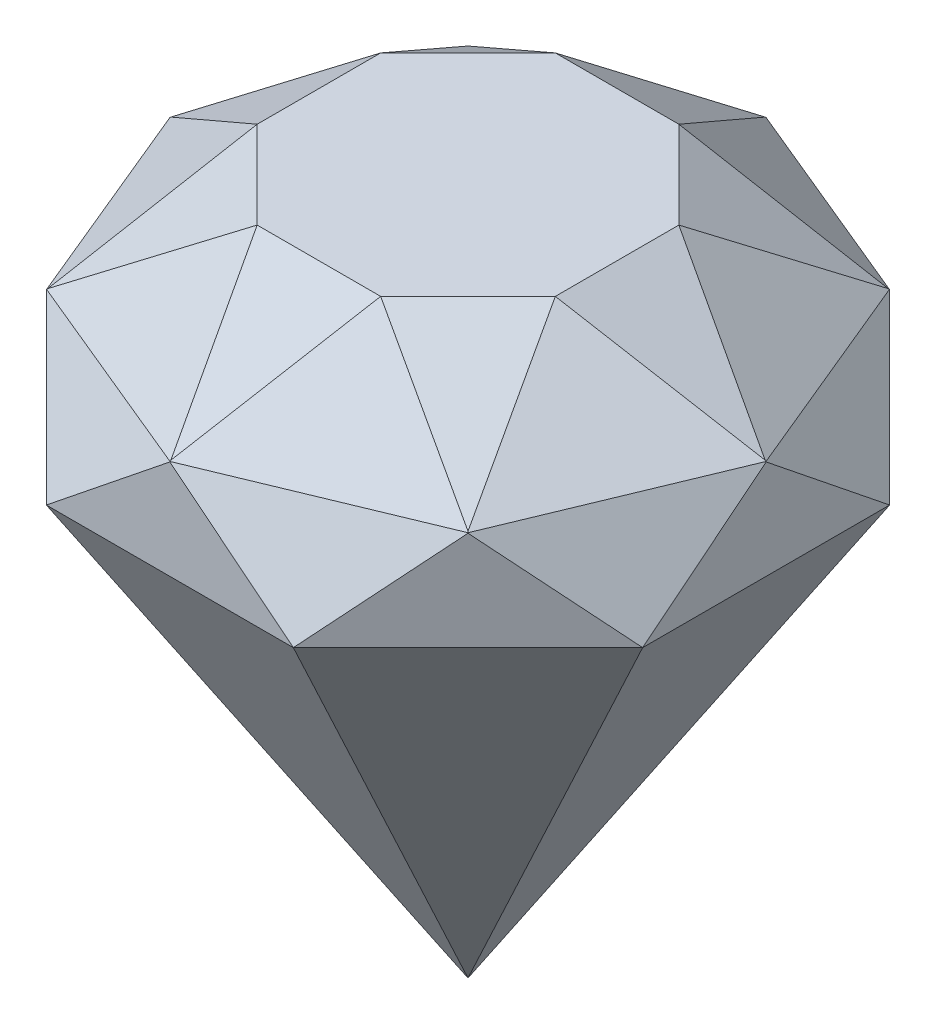
ISO-10303-21;
HEADER;
FILE_DESCRIPTION(('STEP AP214'),'2;1');
FILE_NAME('part.step','',(''),(''),'','','');
FILE_SCHEMA(('AUTOMOTIVE_DESIGN { 1 0 10303 214 1 1 1 1 }'));
ENDSEC;
DATA;
#1=APPLICATION_CONTEXT('core data for automotive mechanical design processes');
#2=APPLICATION_PROTOCOL_DEFINITION('international standard','automotive_design',2000,#1);
#3=PRODUCT_CONTEXT('',#1,'mechanical');
#4=PRODUCT('Part','Part','',(#3));
#5=PRODUCT_RELATED_PRODUCT_CATEGORY('part','',(#4));
#6=PRODUCT_DEFINITION_FORMATION('','',#4);
#7=PRODUCT_DEFINITION_CONTEXT('part definition',#1,'design');
#8=PRODUCT_DEFINITION('design','',#6,#7);
#9=PRODUCT_DEFINITION_SHAPE('','',#8);
#10=(LENGTH_UNIT() NAMED_UNIT(*) SI_UNIT(.MILLI.,.METRE.));
#11=(NAMED_UNIT(*) PLANE_ANGLE_UNIT() SI_UNIT($,.RADIAN.));
#12=(NAMED_UNIT(*) SI_UNIT($,.STERADIAN.) SOLID_ANGLE_UNIT());
#13=UNCERTAINTY_MEASURE_WITH_UNIT(LENGTH_MEASURE(1.E-05),#10,'distance_accuracy_value','');
#14=(GEOMETRIC_REPRESENTATION_CONTEXT(3) GLOBAL_UNCERTAINTY_ASSIGNED_CONTEXT((#13)) GLOBAL_UNIT_ASSIGNED_CONTEXT((#10,
#11,#12)) REPRESENTATION_CONTEXT('',''));
#15=CARTESIAN_POINT('',(0.,0.,0.));
#16=DIRECTION('',(0.,0.,1.));
#17=DIRECTION('',(1.,0.,0.));
#18=AXIS2_PLACEMENT_3D('',#15,#16,#17);
#19=CARTESIAN_POINT('',(-30.,70.,-12.4264068711928));
#20=DIRECTION('',(1.,0.,0.));
#21=DIRECTION('',(0.,0.,-1.));
#22=AXIS2_PLACEMENT_3D('',#19,#20,#21);
#23=PLANE('',#22);
#24=DIRECTION('',(0.,-0.625633794460949,0.780116885619325));
#25=VECTOR('',#24,1.);
#26=CARTESIAN_POINT('',(-30.,69.9582032503442,-12.4599267956623));
#27=LINE('',#26,#25);
#28=CARTESIAN_POINT('',(-30.,59.9656605640165,3.09847456502869E-13));
#29=VERTEX_POINT('',#28);
#30=CARTESIAN_POINT('',(-30.,50.,12.4264068711929));
#31=VERTEX_POINT('',#30);
#32=EDGE_CURVE('E205',#29,#31,#27,.T.);
#33=ORIENTED_EDGE('',*,*,#32,.F.);
#34=DIRECTION('',(0.,0.625633794460936,0.780116885619335));
#35=VECTOR('',#34,1.);
#36=CARTESIAN_POINT('',(-30.,57.8283528954318,-2.66505712573136));
#37=LINE('',#36,#35);
#38=CARTESIAN_POINT('',(-30.,50.,-12.4264068711929));
#39=VERTEX_POINT('',#38);
#40=EDGE_CURVE('E378',#39,#29,#37,.T.);
#41=ORIENTED_EDGE('',*,*,#40,.F.);
#42=DIRECTION('',(0.,0.,-1.));
#43=VECTOR('',#42,1.);
#44=CARTESIAN_POINT('',(-29.9999999999999,50.,30.0000000000003));
#45=LINE('',#44,#43);
#46=EDGE_CURVE('E329',#31,#39,#45,.T.);
#47=ORIENTED_EDGE('',*,*,#46,.F.);
#48=EDGE_LOOP('',(#33,#41,#47));
#49=FACE_BOUND('',#48,.T.);
#50=ADVANCED_FACE('F32',(#49),#23,.F.);
#51=CARTESIAN_POINT('',(-14.9999999999999,70.,30.0000000000002));
#52=DIRECTION('',(0.554700196225229,-0.832050294337844,0.));
#53=DIRECTION('',(0.832050294337844,0.554700196225229,0.));
#54=AXIS2_PLACEMENT_3D('',#51,#52,#53);
#55=PLANE('',#54);
#56=DIRECTION('',(-0.786064837904814,-0.524043225269876,-0.327842597382378));
#57=VECTOR('',#56,1.);
#58=CARTESIAN_POINT('',(-8.87001079003774,74.0866594733082,8.76982661426019));
#59=LINE('',#58,#57);
#60=CARTESIAN_POINT('',(-15.,70.,6.21320343559645));
#61=VERTEX_POINT('',#60);
#62=CARTESIAN_POINT('',(-29.8973342404774,60.0684438396818,3.01080993055436E-13));
#63=VERTEX_POINT('',#62);
#64=EDGE_CURVE('E47',#61,#63,#59,.T.);
#65=ORIENTED_EDGE('',*,*,#64,.F.);
#66=DIRECTION('',(0.,0.,-1.));
#67=VECTOR('',#66,1.);
#68=CARTESIAN_POINT('',(-14.9999999999999,70.,30.0000000000002));
#69=LINE('',#68,#67);
#70=CARTESIAN_POINT('',(-15.,70.,-6.2132034355964));
#71=VERTEX_POINT('',#70);
#72=EDGE_CURVE('E332',#61,#71,#69,.T.);
#73=ORIENTED_EDGE('',*,*,#72,.T.);
#74=DIRECTION('',(0.786064837904806,0.524043225269872,-0.327842597382404));
#75=VECTOR('',#74,1.);
#76=CARTESIAN_POINT('',(-24.3323430802188,63.7784379465208,-2.32098049475403));
#77=LINE('',#76,#75);
#78=EDGE_CURVE('E376',#63,#71,#77,.T.);
#79=ORIENTED_EDGE('',*,*,#78,.F.);
#80=EDGE_LOOP('',(#65,#73,#79));
#81=FACE_BOUND('',#80,.T.);
#82=ADVANCED_FACE('F504',(#81),#55,.F.);
#83=CARTESIAN_POINT('',(-18.6544923551672,21.8943527744636,57.3904784281631));
#84=DIRECTION('',(0.345377445761166,0.430658924974649,0.833814913694384));
#85=DIRECTION('',(0.,-0.888489101827644,0.458897718379059));
#86=AXIS2_PLACEMENT_3D('',#83,#84,#85);
#87=PLANE('',#86);
#88=DIRECTION('',(0.923879532511286,0.,-0.382683432365091));
#89=VECTOR('',#88,1.);
#90=CARTESIAN_POINT('',(-25.6128723590835,60.,40.5914630505627));
#91=LINE('',#90,#89);
#92=CARTESIAN_POINT('',(1.97722553665306E-13,60.,29.9822639480992));
#93=VERTEX_POINT('',#92);
#94=CARTESIAN_POINT('',(21.200662153026,60.,21.2006621530259));
#95=VERTEX_POINT('',#94);
#96=EDGE_CURVE('E279',#93,#95,#91,.T.);
#97=ORIENTED_EDGE('',*,*,#96,.F.);
#98=DIRECTION('',(0.,-0.888489101827645,0.458897718379058));
#99=VECTOR('',#98,1.);
#100=CARTESIAN_POINT('',(3.67761376907083E-13,18.7438798377243,51.2907294911163));
#101=LINE('',#100,#99);
#102=CARTESIAN_POINT('',(2.2139408362154E-13,59.9656605640164,30.));
#103=VERTEX_POINT('',#102);
#104=EDGE_CURVE('E199',#93,#103,#101,.T.);
#105=ORIENTED_EDGE('',*,*,#104,.T.);
#106=DIRECTION('',(0.78011688561933,-0.625633794460942,0.));
#107=VECTOR('',#106,1.);
#108=CARTESIAN_POINT('',(-12.4599267956625,69.958203250344,30.));
#109=LINE('',#108,#107);
#110=CARTESIAN_POINT('',(12.426406871193,50.,30.));
#111=VERTEX_POINT('',#110);
#112=EDGE_CURVE('E284',#103,#111,#109,.T.);
#113=ORIENTED_EDGE('',*,*,#112,.T.);
#114=DIRECTION('',(0.55162593993955,0.625633794460949,-0.55162593993956));
#115=VECTOR('',#114,1.);
#116=CARTESIAN_POINT('',(19.3287234697424,57.8283528954322,23.0976834014505));
#117=LINE('',#116,#115);
#118=CARTESIAN_POINT('',(21.2132034355965,59.9656605640166,21.2132034355964));
#119=VERTEX_POINT('',#118);
#120=EDGE_CURVE('E360',#111,#119,#117,.T.);
#121=ORIENTED_EDGE('',*,*,#120,.T.);
#122=DIRECTION('',(-0.324489688536868,0.888489101827644,-0.324489688536867));
#123=VECTOR('',#122,1.);
#124=CARTESIAN_POINT('',(31.8007953039603,30.9756484867253,31.8007953039602));
#125=LINE('',#124,#123);
#126=EDGE_CURVE('E365',#119,#95,#125,.T.);
#127=ORIENTED_EDGE('',*,*,#126,.T.);
#128=EDGE_LOOP('',(#97,#105,#113,#121,#127));
#129=FACE_BOUND('',#128,.T.);
#130=ADVANCED_FACE('F506',(#129),#87,.T.);
#131=CARTESIAN_POINT('',(-20.2586000833427,47.795494651662,53.5178197952943));
#132=DIRECTION('',(0.251555377840445,0.753589008182481,0.607308404870289));
#133=DIRECTION('',(0.,-0.627486548407002,0.77862740227163));
#134=AXIS2_PLACEMENT_3D('',#131,#132,#133);
#135=PLANE('',#134);
#136=DIRECTION('',(-0.327842597382391,-0.524043225269874,0.786064837904811));
#137=VECTOR('',#136,1.);
#138=CARTESIAN_POINT('',(8.7698266142603,74.0866594733083,8.87001079003763));
#139=LINE('',#138,#137);
#140=CARTESIAN_POINT('',(6.21320343559661,70.,14.9999999999999));
#141=VERTEX_POINT('',#140);
#142=CARTESIAN_POINT('',(1.98842678433842E-13,60.0684438396821,29.8973342404769));
#143=VERTEX_POINT('',#142);
#144=EDGE_CURVE('E281',#141,#143,#139,.T.);
#145=ORIENTED_EDGE('',*,*,#144,.T.);
#146=DIRECTION('',(0.,-0.627486548407003,0.77862740227163));
#147=VECTOR('',#146,1.);
#148=CARTESIAN_POINT('',(3.46944695195361E-13,43.6956457626062,50.2138004133942));
#149=LINE('',#148,#147);
#150=EDGE_CURVE('E210',#143,#93,#149,.T.);
#151=ORIENTED_EDGE('',*,*,#150,.T.);
#152=ORIENTED_EDGE('',*,*,#96,.T.);
#153=DIRECTION('',(-0.550572716163937,0.627486548407002,-0.550572716163935));
#154=VECTOR('',#153,1.);
#155=CARTESIAN_POINT('',(22.6457886690081,58.3529923970024,22.645788669008));
#156=LINE('',#155,#154);
#157=CARTESIAN_POINT('',(21.1406077808423,60.0684438396818,21.1406077808422));
#158=VERTEX_POINT('',#157);
#159=EDGE_CURVE('E363',#95,#158,#156,.T.);
#160=ORIENTED_EDGE('',*,*,#159,.T.);
#161=DIRECTION('',(-0.787651501105693,0.524043225269875,-0.324012053563898));
#162=VECTOR('',#161,1.);
#163=CARTESIAN_POINT('',(18.7732015335419,61.6435353663504,20.1667403296522));
#164=LINE('',#163,#162);
#165=EDGE_CURVE('E358',#158,#141,#164,.T.);
#166=ORIENTED_EDGE('',*,*,#165,.T.);
#167=EDGE_LOOP('',(#145,#151,#152,#160,#166));
#168=FACE_BOUND('',#167,.T.);
#169=ADVANCED_FACE('F497',(#168),#135,.T.);
#170=CARTESIAN_POINT('',(-12.4264068711929,70.,30.));
#171=DIRECTION('',(0.,0.,-1.));
#172=DIRECTION('',(-1.,0.,0.));
#173=AXIS2_PLACEMENT_3D('',#170,#171,#172);
#174=PLANE('',#173);
#175=DIRECTION('',(0.78011688561934,0.62563379446093,0.));
#176=VECTOR('',#175,1.);
#177=CARTESIAN_POINT('',(-2.6650571257315,57.8283528954317,30.));
#178=LINE('',#177,#176);
#179=CARTESIAN_POINT('',(-12.4264068711926,50.,30.0000000000002));
#180=VERTEX_POINT('',#179);
#181=EDGE_CURVE('E212',#180,#103,#178,.T.);
#182=ORIENTED_EDGE('',*,*,#181,.F.);
#183=DIRECTION('',(-1.,0.,0.));
#184=VECTOR('',#183,1.);
#185=CARTESIAN_POINT('',(30.0000000000001,50.,30.));
#186=LINE('',#185,#184);
#187=EDGE_CURVE('E311',#111,#180,#186,.T.);
#188=ORIENTED_EDGE('',*,*,#187,.F.);
#189=ORIENTED_EDGE('',*,*,#112,.F.);
#190=EDGE_LOOP('',(#182,#188,#189));
#191=FACE_BOUND('',#190,.T.);
#192=ADVANCED_FACE('F453',(#191),#174,.F.);
#193=CARTESIAN_POINT('',(30.0000000000001,70.,15.));
#194=DIRECTION('',(0.,-0.832050294337844,-0.554700196225229));
#195=DIRECTION('',(0.,0.554700196225229,-0.832050294337844));
#196=AXIS2_PLACEMENT_3D('',#193,#194,#195);
#197=PLANE('',#196);
#198=DIRECTION('',(-0.32784259738241,0.52404322526987,-0.786064837904805));
#199=VECTOR('',#198,1.);
#200=CARTESIAN_POINT('',(-2.32098049475389,63.7784379465206,24.332343080219));
#201=LINE('',#200,#199);
#202=CARTESIAN_POINT('',(-6.21320343559615,70.,15.0000000000002));
#203=VERTEX_POINT('',#202);
#204=EDGE_CURVE('E208',#143,#203,#201,.T.);
#205=ORIENTED_EDGE('',*,*,#204,.F.);
#206=ORIENTED_EDGE('',*,*,#144,.F.);
#207=DIRECTION('',(-1.,0.,0.));
#208=VECTOR('',#207,1.);
#209=CARTESIAN_POINT('',(30.0000000000001,70.,15.));
#210=LINE('',#209,#208);
#211=EDGE_CURVE('E314',#141,#203,#210,.T.);
#212=ORIENTED_EDGE('',*,*,#211,.T.);
#213=EDGE_LOOP('',(#205,#206,#212));
#214=FACE_BOUND('',#213,.T.);
#215=ADVANCED_FACE('F500',(#214),#197,.F.);
#216=CARTESIAN_POINT('',(-30.,70.,12.426406871193));
#217=DIRECTION('',(0.707106781186544,0.,-0.707106781186551));
#218=DIRECTION('',(-0.707106781186551,0.,-0.707106781186544));
#219=AXIS2_PLACEMENT_3D('',#216,#217,#218);
#220=PLANE('',#219);
#221=DIRECTION('',(0.551625939939558,-0.625633794460949,0.551625939939552));
#222=VECTOR('',#221,1.);
#223=CARTESIAN_POINT('',(-30.0237021658972,69.9582032503442,12.4027047052958));
#224=LINE('',#223,#222);
#225=CARTESIAN_POINT('',(-21.2132034355962,59.9656605640166,21.2132034355967));
#226=VERTEX_POINT('',#225);
#227=EDGE_CURVE('E11',#226,#180,#224,.T.);
#228=ORIENTED_EDGE('',*,*,#227,.F.);
#229=DIRECTION('',(0.551625939939565,0.625633794460936,0.551625939939559));
#230=VECTOR('',#229,1.);
#231=CARTESIAN_POINT('',(-23.0976834014506,57.8283528954318,19.3287234697423));
#232=LINE('',#231,#230);
#233=EDGE_CURVE('E178',#31,#226,#232,.T.);
#234=ORIENTED_EDGE('',*,*,#233,.F.);
#235=DIRECTION('',(-0.707106781186551,0.,-0.707106781186544));
#236=VECTOR('',#235,1.);
#237=CARTESIAN_POINT('',(8.78679656440395,50.,51.2132034355965));
#238=LINE('',#237,#236);
#239=EDGE_CURVE('E317',#180,#31,#238,.T.);
#240=ORIENTED_EDGE('',*,*,#239,.F.);
#241=EDGE_LOOP('',(#228,#234,#240));
#242=FACE_BOUND('',#241,.T.);
#243=ADVANCED_FACE('F448',(#242),#220,.F.);
#244=CARTESIAN_POINT('',(19.3933982822021,70.,40.6066017177982));
#245=DIRECTION('',(0.392232270276366,-0.832050294337844,-0.39223227027637));
#246=DIRECTION('',(0.,0.426401432711223,-0.90453403373329));
#247=AXIS2_PLACEMENT_3D('',#244,#245,#246);
#248=PLANE('',#247);
#249=DIRECTION('',(-0.787651501105689,-0.524043225269876,0.324012053563909));
#250=VECTOR('',#249,1.);
#251=CARTESIAN_POINT('',(3.1379768761445,76.2215620534789,11.1532541589774));
#252=LINE('',#251,#250);
#253=CARTESIAN_POINT('',(-21.1406077808421,60.0684438396817,21.1406077808426));
#254=VERTEX_POINT('',#253);
#255=EDGE_CURVE('E40',#203,#254,#252,.T.);
#256=ORIENTED_EDGE('',*,*,#255,.F.);
#257=DIRECTION('',(-0.707106781186551,0.,-0.707106781186544));
#258=VECTOR('',#257,1.);
#259=CARTESIAN_POINT('',(19.3933982822021,70.,40.6066017177982));
#260=LINE('',#259,#258);
#261=EDGE_CURVE('E328',#203,#61,#260,.T.);
#262=ORIENTED_EDGE('',*,*,#261,.T.);
#263=DIRECTION('',(0.324012053563883,0.524043225269872,-0.787651501105702));
#264=VECTOR('',#263,1.);
#265=CARTESIAN_POINT('',(-20.1667403296523,61.64353536635,18.7732015335426));
#266=LINE('',#265,#264);
#267=EDGE_CURVE('E203',#254,#61,#266,.T.);
#268=ORIENTED_EDGE('',*,*,#267,.F.);
#269=EDGE_LOOP('',(#256,#262,#268));
#270=FACE_BOUND('',#269,.T.);
#271=ADVANCED_FACE('F502',(#270),#248,.F.);
#272=CARTESIAN_POINT('',(-27.3904784281636,21.8943527744636,-53.7719145160255));
#273=DIRECTION('',(-0.833814913694387,0.430658924974649,-0.345377445761158));
#274=DIRECTION('',(-0.458897718379058,-0.888489101827645,0.));
#275=AXIS2_PLACEMENT_3D('',#272,#273,#274);
#276=PLANE('',#275);
#277=ORIENTED_EDGE('',*,*,#40,.T.);
#278=DIRECTION('',(0.458897718379059,0.888489101827644,0.));
#279=VECTOR('',#278,1.);
#280=CARTESIAN_POINT('',(-44.9731160131113,30.9756484867253,4.71844785465692E-13));
#281=LINE('',#280,#279);
#282=CARTESIAN_POINT('',(-29.9822639480993,60.,3.03053162670925E-13));
#283=VERTEX_POINT('',#282);
#284=EDGE_CURVE('E382',#29,#283,#281,.T.);
#285=ORIENTED_EDGE('',*,*,#284,.T.);
#286=DIRECTION('',(-0.382683432365081,0.,0.923879532511291));
#287=VECTOR('',#286,1.);
#288=CARTESIAN_POINT('',(-10.5914630505631,60.,-46.8135345121093));
#289=LINE('',#288,#287);
#290=CARTESIAN_POINT('',(-21.2006621530261,60.,-21.2006621530259));
#291=VERTEX_POINT('',#290);
#292=EDGE_CURVE('E215',#291,#283,#289,.T.);
#293=ORIENTED_EDGE('',*,*,#292,.F.);
#294=DIRECTION('',(0.324489688536869,0.888489101827644,0.324489688536866));
#295=VECTOR('',#294,1.);
#296=CARTESIAN_POINT('',(-31.8007953039604,30.9756484867255,-31.8007953039601));
#297=LINE('',#296,#295);
#298=CARTESIAN_POINT('',(-21.2132034355965,59.9656605640167,-21.2132034355963));
#299=VERTEX_POINT('',#298);
#300=EDGE_CURVE('E221',#299,#291,#297,.T.);
#301=ORIENTED_EDGE('',*,*,#300,.F.);
#302=DIRECTION('',(-0.551625939939554,-0.625633794460949,0.551625939939556));
#303=VECTOR('',#302,1.);
#304=CARTESIAN_POINT('',(-12.4027047052957,69.9582032503442,-30.0237021658972));
#305=LINE('',#304,#303);
#306=EDGE_CURVE('E236',#299,#39,#305,.T.);
#307=ORIENTED_EDGE('',*,*,#306,.T.);
#308=EDGE_LOOP('',(#277,#285,#293,#301,#307));
#309=FACE_BOUND('',#308,.T.);
#310=ADVANCED_FACE('F385',(#309),#276,.T.);
#311=CARTESIAN_POINT('',(-23.5178197952947,47.795494651662,-52.16780678785));
#312=DIRECTION('',(-0.607308404870292,0.753589008182481,-0.251555377840439));
#313=DIRECTION('',(-0.778627402271629,-0.627486548407003,0.));
#314=AXIS2_PLACEMENT_3D('',#311,#312,#313);
#315=PLANE('',#314);
#316=ORIENTED_EDGE('',*,*,#292,.T.);
#317=DIRECTION('',(0.77862740227163,0.627486548407002,0.));
#318=VECTOR('',#317,1.);
#319=CARTESIAN_POINT('',(-32.0259814663462,58.3529923970024,3.2612801348364E-13));
#320=LINE('',#319,#318);
#321=EDGE_CURVE('E188',#283,#63,#320,.T.);
#322=ORIENTED_EDGE('',*,*,#321,.T.);
#323=ORIENTED_EDGE('',*,*,#78,.T.);
#324=DIRECTION('',(-0.324012053563906,-0.524043225269875,-0.78765150110569));
#325=VECTOR('',#324,1.);
#326=CARTESIAN_POINT('',(-11.1532541589774,76.2215620534789,3.13797687614447));
#327=LINE('',#326,#325);
#328=CARTESIAN_POINT('',(-21.1406077808426,60.0684438396816,-21.1406077808423));
#329=VERTEX_POINT('',#328);
#330=EDGE_CURVE('E234',#71,#329,#327,.T.);
#331=ORIENTED_EDGE('',*,*,#330,.T.);
#332=DIRECTION('',(0.550572716163939,0.627486548407001,0.550572716163933));
#333=VECTOR('',#332,1.);
#334=CARTESIAN_POINT('',(-22.6457886690081,58.3529923970025,-22.6457886690079));
#335=LINE('',#334,#333);
#336=EDGE_CURVE('E223',#291,#329,#335,.T.);
#337=ORIENTED_EDGE('',*,*,#336,.F.);
#338=EDGE_LOOP('',(#316,#322,#323,#331,#337));
#339=FACE_BOUND('',#338,.T.);
#340=ADVANCED_FACE('F391',(#339),#315,.T.);
#341=CARTESIAN_POINT('',(12.4264068711929,70.,-30.));
#342=DIRECTION('',(0.,0.,1.));
#343=DIRECTION('',(1.,0.,0.));
#344=AXIS2_PLACEMENT_3D('',#341,#342,#343);
#345=PLANE('',#344);
#346=DIRECTION('',(-0.78011688561933,-0.625633794460942,0.));
#347=VECTOR('',#346,1.);
#348=CARTESIAN_POINT('',(12.4599267956625,69.958203250344,-30.));
#349=LINE('',#348,#347);
#350=CARTESIAN_POINT('',(-1.04678456804118E-13,59.965660564016,-30.0000000000003));
#351=VERTEX_POINT('',#350);
#352=CARTESIAN_POINT('',(-12.4264068711928,50.,-30.0000000000001));
#353=VERTEX_POINT('',#352);
#354=EDGE_CURVE('E232',#351,#353,#349,.T.);
#355=ORIENTED_EDGE('',*,*,#354,.F.);
#356=DIRECTION('',(-0.780116885619335,0.625633794460936,0.));
#357=VECTOR('',#356,1.);
#358=CARTESIAN_POINT('',(2.66505712573147,57.8283528954318,-30.));
#359=LINE('',#358,#357);
#360=CARTESIAN_POINT('',(12.4264068711924,50.,-30.0000000000003));
#361=VERTEX_POINT('',#360);
#362=EDGE_CURVE('E276',#361,#351,#359,.T.);
#363=ORIENTED_EDGE('',*,*,#362,.F.);
#364=DIRECTION('',(1.,0.,0.));
#365=VECTOR('',#364,1.);
#366=CARTESIAN_POINT('',(-12.4264068711929,50.,-30.));
#367=LINE('',#366,#365);
#368=EDGE_CURVE('E346',#353,#361,#367,.T.);
#369=ORIENTED_EDGE('',*,*,#368,.F.);
#370=EDGE_LOOP('',(#355,#363,#369));
#371=FACE_BOUND('',#370,.T.);
#372=ADVANCED_FACE('F34',(#371),#345,.F.);
#373=CARTESIAN_POINT('',(-12.4264068711929,70.,-15.));
#374=DIRECTION('',(0.,-0.832050294337843,0.554700196225229));
#375=DIRECTION('',(0.,-0.554700196225229,-0.832050294337844));
#376=AXIS2_PLACEMENT_3D('',#373,#374,#375);
#377=PLANE('',#376);
#378=DIRECTION('',(0.327842597382391,-0.524043225269874,-0.78606483790481));
#379=VECTOR('',#378,1.);
#380=CARTESIAN_POINT('',(-6.88100331668556,71.0674512900854,-13.3988230648719));
#381=LINE('',#380,#379);
#382=CARTESIAN_POINT('',(-6.21320343559658,70.,-14.9999999999999));
#383=VERTEX_POINT('',#382);
#384=CARTESIAN_POINT('',(-1.02253603365216E-13,60.0684438396819,-29.8973342404772));
#385=VERTEX_POINT('',#384);
#386=EDGE_CURVE('E228',#383,#385,#381,.T.);
#387=ORIENTED_EDGE('',*,*,#386,.F.);
#388=DIRECTION('',(1.,0.,0.));
#389=VECTOR('',#388,1.);
#390=CARTESIAN_POINT('',(0.,70.,-15.));
#391=LINE('',#390,#389);
#392=CARTESIAN_POINT('',(6.21320343559625,70.,-15.0000000000001));
#393=VERTEX_POINT('',#392);
#394=EDGE_CURVE('E355',#383,#393,#391,.T.);
#395=ORIENTED_EDGE('',*,*,#394,.T.);
#396=DIRECTION('',(0.327842597382401,0.524043225269872,0.786064837904808));
#397=VECTOR('',#396,1.);
#398=CARTESIAN_POINT('',(4.20980379232898,66.7976461297437,-19.8035308053844));
#399=LINE('',#398,#397);
#400=EDGE_CURVE('E272',#385,#393,#399,.T.);
#401=ORIENTED_EDGE('',*,*,#400,.F.);
#402=EDGE_LOOP('',(#387,#395,#401));
#403=FACE_BOUND('',#402,.T.);
#404=ADVANCED_FACE('F410',(#403),#377,.F.);
#405=CARTESIAN_POINT('',(-12.4264068711929,70.,-30.));
#406=DIRECTION('',(0.707106781186549,0.,0.707106781186546));
#407=DIRECTION('',(0.707106781186546,0.,-0.707106781186549));
#408=AXIS2_PLACEMENT_3D('',#405,#406,#407);
#409=PLANE('',#408);
#410=DIRECTION('',(-0.551625939939558,0.625633794460943,0.55162593993956));
#411=VECTOR('',#410,1.);
#412=CARTESIAN_POINT('',(-19.3287234697423,57.828352895432,-23.0976834014506));
#413=LINE('',#412,#411);
#414=EDGE_CURVE('E230',#353,#299,#413,.T.);
#415=ORIENTED_EDGE('',*,*,#414,.F.);
#416=DIRECTION('',(0.707106781186546,0.,-0.707106781186549));
#417=VECTOR('',#416,1.);
#418=CARTESIAN_POINT('',(-51.2132034355965,50.,8.78679656440373));
#419=LINE('',#418,#417);
#420=EDGE_CURVE('E335',#39,#353,#419,.T.);
#421=ORIENTED_EDGE('',*,*,#420,.F.);
#422=ORIENTED_EDGE('',*,*,#306,.F.);
#423=EDGE_LOOP('',(#415,#421,#422));
#424=FACE_BOUND('',#423,.T.);
#425=ADVANCED_FACE('F437',(#424),#409,.F.);
#426=CARTESIAN_POINT('',(-40.6066017177982,70.,19.3933982822019));
#427=DIRECTION('',(0.392232270276369,-0.832050294337844,0.392232270276367));
#428=DIRECTION('',(0.904534033733291,0.426401432711221,0.));
#429=AXIS2_PLACEMENT_3D('',#426,#427,#428);
#430=PLANE('',#429);
#431=DIRECTION('',(0.787651501105696,0.524043225269874,0.324012053563894));
#432=VECTOR('',#431,1.);
#433=CARTESIAN_POINT('',(-18.7732015335421,61.6435353663502,-20.1667403296523));
#434=LINE('',#433,#432);
#435=EDGE_CURVE('E226',#329,#383,#434,.T.);
#436=ORIENTED_EDGE('',*,*,#435,.F.);
#437=ORIENTED_EDGE('',*,*,#330,.F.);
#438=DIRECTION('',(0.707106781186546,0.,-0.707106781186549));
#439=VECTOR('',#438,1.);
#440=CARTESIAN_POINT('',(-40.6066017177982,70.,19.3933982822019));
#441=LINE('',#440,#439);
#442=EDGE_CURVE('E343',#71,#383,#441,.T.);
#443=ORIENTED_EDGE('',*,*,#442,.T.);
#444=EDGE_LOOP('',(#436,#437,#443));
#445=FACE_BOUND('',#444,.T.);
#446=ADVANCED_FACE('F400',(#445),#430,.F.);
#447=CARTESIAN_POINT('',(12.4264068711931,70.,29.9999999999999));
#448=DIRECTION('',(-0.707106781186554,0.,-0.707106781186541));
#449=DIRECTION('',(-0.707106781186541,0.,0.707106781186554));
#450=AXIS2_PLACEMENT_3D('',#447,#448,#449);
#451=PLANE('',#450);
#452=DIRECTION('',(0.551625939939557,-0.625633794460936,-0.551625939939567));
#453=VECTOR('',#452,1.);
#454=CARTESIAN_POINT('',(12.4027047052956,69.9582032503437,30.0237021658974));
#455=LINE('',#454,#453);
#456=CARTESIAN_POINT('',(30.0000000000001,50.,12.4264068711927));
#457=VERTEX_POINT('',#456);
#458=EDGE_CURVE('E266',#119,#457,#455,.T.);
#459=ORIENTED_EDGE('',*,*,#458,.F.);
#460=ORIENTED_EDGE('',*,*,#120,.F.);
#461=DIRECTION('',(-0.707106781186541,0.,0.707106781186554));
#462=VECTOR('',#461,1.);
#463=CARTESIAN_POINT('',(51.2132034355965,50.,-8.78679656440417));
#464=LINE('',#463,#462);
#465=EDGE_CURVE('E299',#457,#111,#464,.T.);
#466=ORIENTED_EDGE('',*,*,#465,.F.);
#467=EDGE_LOOP('',(#459,#460,#466));
#468=FACE_BOUND('',#467,.T.);
#469=ADVANCED_FACE('F520',(#468),#451,.F.);
#470=CARTESIAN_POINT('',(40.6066017177982,70.,-19.3933982822023));
#471=DIRECTION('',(-0.392232270276372,-0.832050294337844,-0.392232270276365));
#472=DIRECTION('',(0.904534033733289,-0.426401432711224,0.));
#473=AXIS2_PLACEMENT_3D('',#470,#471,#472);
#474=PLANE('',#473);
#475=DIRECTION('',(0.324012053563894,-0.524043225269872,0.787651501105697));
#476=VECTOR('',#475,1.);
#477=CARTESIAN_POINT('',(11.1532541589773,76.2215620534792,-3.13797687614521));
#478=LINE('',#477,#476);
#479=CARTESIAN_POINT('',(15.0000000000001,70.,6.21320343559631));
#480=VERTEX_POINT('',#479);
#481=EDGE_CURVE('E55',#480,#158,#478,.T.);
#482=ORIENTED_EDGE('',*,*,#481,.F.);
#483=DIRECTION('',(-0.707106781186541,0.,0.707106781186554));
#484=VECTOR('',#483,1.);
#485=CARTESIAN_POINT('',(40.6066017177982,70.,-19.3933982822023));
#486=LINE('',#485,#484);
#487=EDGE_CURVE('E310',#480,#141,#486,.T.);
#488=ORIENTED_EDGE('',*,*,#487,.T.);
#489=ORIENTED_EDGE('',*,*,#165,.F.);
#490=EDGE_LOOP('',(#482,#488,#489));
#491=FACE_BOUND('',#490,.T.);
#492=ADVANCED_FACE('F494',(#491),#474,.F.);
#493=CARTESIAN_POINT('',(30.0000000000001,70.,12.4264068711926));
#494=DIRECTION('',(-1.,0.,0.));
#495=DIRECTION('',(0.,0.,1.));
#496=AXIS2_PLACEMENT_3D('',#493,#494,#495);
#497=PLANE('',#496);
#498=DIRECTION('',(0.,0.625633794460949,-0.780116885619325));
#499=VECTOR('',#498,1.);
#500=CARTESIAN_POINT('',(30.,57.8283528954322,2.66505712573107));
#501=LINE('',#500,#499);
#502=CARTESIAN_POINT('',(30.,59.9656605640166,-1.13788022970777E-13));
#503=VERTEX_POINT('',#502);
#504=EDGE_CURVE('E268',#457,#503,#501,.T.);
#505=ORIENTED_EDGE('',*,*,#504,.F.);
#506=DIRECTION('',(0.,0.,1.));
#507=VECTOR('',#506,1.);
#508=CARTESIAN_POINT('',(29.9999999999997,50.,-30.0000000000008));
#509=LINE('',#508,#507);
#510=CARTESIAN_POINT('',(30.,50.,-12.4264068711931));
#511=VERTEX_POINT('',#510);
#512=EDGE_CURVE('E293',#511,#457,#509,.T.);
#513=ORIENTED_EDGE('',*,*,#512,.F.);
#514=DIRECTION('',(0.,-0.625633794460936,-0.780116885619335));
#515=VECTOR('',#514,1.);
#516=CARTESIAN_POINT('',(30.0000000000001,69.9582032503437,12.4599267956624));
#517=LINE('',#516,#515);
#518=EDGE_CURVE('E274',#503,#511,#517,.T.);
#519=ORIENTED_EDGE('',*,*,#518,.F.);
#520=EDGE_LOOP('',(#505,#513,#519));
#521=FACE_BOUND('',#520,.T.);
#522=ADVANCED_FACE('F470',(#521),#497,.F.);
#523=CARTESIAN_POINT('',(29.9999999999999,70.,-12.4264068711932));
#524=DIRECTION('',(-0.707106781186539,0.,0.707106781186556));
#525=DIRECTION('',(0.707106781186556,0.,0.707106781186539));
#526=AXIS2_PLACEMENT_3D('',#523,#524,#525);
#527=PLANE('',#526);
#528=DIRECTION('',(-0.551625939939569,-0.625633794460936,-0.551625939939556));
#529=VECTOR('',#528,1.);
#530=CARTESIAN_POINT('',(30.0237021658973,69.9582032503438,-12.4027047052957));
#531=LINE('',#530,#529);
#532=CARTESIAN_POINT('',(21.2132034355963,59.9656605640166,-21.2132034355965));
#533=VERTEX_POINT('',#532);
#534=EDGE_CURVE('E374',#533,#361,#531,.T.);
#535=ORIENTED_EDGE('',*,*,#534,.F.);
#536=DIRECTION('',(-0.551625939939562,0.625633794460949,-0.551625939939548));
#537=VECTOR('',#536,1.);
#538=CARTESIAN_POINT('',(23.0976834014504,57.8283528954322,-19.3287234697425));
#539=LINE('',#538,#537);
#540=EDGE_CURVE('E372',#511,#533,#539,.T.);
#541=ORIENTED_EDGE('',*,*,#540,.F.);
#542=DIRECTION('',(0.707106781186556,0.,0.707106781186539));
#543=VECTOR('',#542,1.);
#544=CARTESIAN_POINT('',(-8.78679656440431,50.,-51.2132034355964));
#545=LINE('',#544,#543);
#546=EDGE_CURVE('E286',#361,#511,#545,.T.);
#547=ORIENTED_EDGE('',*,*,#546,.F.);
#548=EDGE_LOOP('',(#535,#541,#547));
#549=FACE_BOUND('',#548,.T.);
#550=ADVANCED_FACE('F521',(#549),#527,.F.);
#551=CARTESIAN_POINT('',(-19.3933982822024,70.,-40.6066017177981));
#552=DIRECTION('',(-0.392232270276363,-0.832050294337844,0.392232270276373));
#553=DIRECTION('',(0.,-0.426401432711225,-0.904534033733289));
#554=AXIS2_PLACEMENT_3D('',#551,#552,#553);
#555=PLANE('',#554);
#556=DIRECTION('',(0.787651501105696,-0.524043225269872,-0.324012053563897));
#557=VECTOR('',#556,1.);
#558=CARTESIAN_POINT('',(-3.13797687614525,76.2215620534792,-11.1532541589774));
#559=LINE('',#558,#557);
#560=CARTESIAN_POINT('',(21.1406077808422,60.0684438396818,-21.1406077808424));
#561=VERTEX_POINT('',#560);
#562=EDGE_CURVE('E370',#393,#561,#559,.T.);
#563=ORIENTED_EDGE('',*,*,#562,.F.);
#564=DIRECTION('',(0.707106781186556,0.,0.707106781186539));
#565=VECTOR('',#564,1.);
#566=CARTESIAN_POINT('',(-19.3933982822024,70.,-40.6066017177981));
#567=LINE('',#566,#565);
#568=CARTESIAN_POINT('',(14.9999999999999,70.,-6.21320343559662));
#569=VERTEX_POINT('',#568);
#570=EDGE_CURVE('E292',#393,#569,#567,.T.);
#571=ORIENTED_EDGE('',*,*,#570,.T.);
#572=DIRECTION('',(-0.324012053563896,0.524043225269876,0.787651501105694));
#573=VECTOR('',#572,1.);
#574=CARTESIAN_POINT('',(20.1667403296521,61.6435353663504,-18.7732015335419));
#575=LINE('',#574,#573);
#576=EDGE_CURVE('E270',#561,#569,#575,.T.);
#577=ORIENTED_EDGE('',*,*,#576,.F.);
#578=EDGE_LOOP('',(#563,#571,#577));
#579=FACE_BOUND('',#578,.T.);
#580=ADVANCED_FACE('F524',(#579),#555,.F.);
#581=CARTESIAN_POINT('',(14.9999999999997,70.,-30.0000000000006));
#582=DIRECTION('',(-0.554700196225229,-0.832050294337844,0.));
#583=DIRECTION('',(0.832050294337844,-0.554700196225229,0.));
#584=AXIS2_PLACEMENT_3D('',#581,#582,#583);
#585=PLANE('',#584);
#586=DIRECTION('',(-0.78606483790481,0.524043225269876,0.327842597382389));
#587=VECTOR('',#586,1.);
#588=CARTESIAN_POINT('',(24.3323430802184,63.7784379465211,2.32098049475428));
#589=LINE('',#588,#587);
#590=CARTESIAN_POINT('',(29.8973342404774,60.0684438396818,-1.17158422752632E-13));
#591=VERTEX_POINT('',#590);
#592=EDGE_CURVE('E264',#591,#480,#589,.T.);
#593=ORIENTED_EDGE('',*,*,#592,.F.);
#594=DIRECTION('',(0.786064837904811,-0.524043225269872,0.327842597382393));
#595=VECTOR('',#594,1.);
#596=CARTESIAN_POINT('',(8.87001079003728,74.0866594733084,-8.76982661426061));
#597=LINE('',#596,#595);
#598=EDGE_CURVE('E368',#569,#591,#597,.T.);
#599=ORIENTED_EDGE('',*,*,#598,.F.);
#600=DIRECTION('',(0.,0.,1.));
#601=VECTOR('',#600,1.);
#602=CARTESIAN_POINT('',(14.9999999999997,70.,-30.0000000000006));
#603=LINE('',#602,#601);
#604=EDGE_CURVE('E296',#569,#480,#603,.T.);
#605=ORIENTED_EDGE('',*,*,#604,.T.);
#606=EDGE_LOOP('',(#593,#599,#605));
#607=FACE_BOUND('',#606,.T.);
#608=ADVANCED_FACE('F488',(#607),#585,.F.);
#609=CARTESIAN_POINT('',(0.,70.,0.));
#610=DIRECTION('',(0.,1.,0.));
#611=DIRECTION('',(0.,0.,1.));
#612=AXIS2_PLACEMENT_3D('',#609,#610,#611);
#613=PLANE('',#612);
#614=ORIENTED_EDGE('',*,*,#570,.F.);
#615=ORIENTED_EDGE('',*,*,#394,.F.);
#616=ORIENTED_EDGE('',*,*,#442,.F.);
#617=ORIENTED_EDGE('',*,*,#72,.F.);
#618=ORIENTED_EDGE('',*,*,#261,.F.);
#619=ORIENTED_EDGE('',*,*,#211,.F.);
#620=ORIENTED_EDGE('',*,*,#487,.F.);
#621=ORIENTED_EDGE('',*,*,#604,.F.);
#622=EDGE_LOOP('',(#614,#615,#616,#617,#618,#619,#620,#621));
#623=FACE_BOUND('',#622,.T.);
#624=ADVANCED_FACE('F406',(#623),#613,.T.);
#625=CARTESIAN_POINT('',(-12.4264068711929,50.,-30.));
#626=DIRECTION('',(0.,0.514495755427526,0.857492925712544));
#627=DIRECTION('',(0.,-0.857492925712544,0.514495755427526));
#628=AXIS2_PLACEMENT_3D('',#625,#626,#627);
#629=PLANE('',#628);
#630=DIRECTION('',(0.208430594365709,-0.838659946218632,0.503195967731179));
#631=VECTOR('',#630,1.);
#632=CARTESIAN_POINT('',(-12.2361673742744,49.2345353774007,-29.5407212264404));
#633=LINE('',#632,#631);
#634=CARTESIAN_POINT('',(0.,0.,0.));
#635=VERTEX_POINT('',#634);
#636=EDGE_CURVE('E349',#353,#635,#633,.T.);
#637=ORIENTED_EDGE('',*,*,#636,.F.);
#638=ORIENTED_EDGE('',*,*,#368,.T.);
#639=DIRECTION('',(0.208430594365709,0.838659946218632,-0.503195967731179));
#640=VECTOR('',#639,1.);
#641=CARTESIAN_POINT('',(12.2361673742744,49.2345353774007,-29.5407212264404));
#642=LINE('',#641,#640);
#643=EDGE_CURVE('E352',#635,#361,#642,.T.);
#644=ORIENTED_EDGE('',*,*,#643,.F.);
#645=EDGE_LOOP('',(#637,#638,#644));
#646=FACE_BOUND('',#645,.T.);
#647=ADVANCED_FACE('F430',(#646),#629,.F.);
#648=CARTESIAN_POINT('',(-51.2132034355965,50.,8.78679656440373));
#649=DIRECTION('',(0.606339062590833,0.514495755427526,0.606339062590831));
#650=DIRECTION('',(0.707106781186546,0.,-0.707106781186549));
#651=AXIS2_PLACEMENT_3D('',#648,#649,#650);
#652=PLANE('',#651);
#653=DIRECTION('',(-0.50319596773118,0.838659946218632,-0.208430594365707));
#654=VECTOR('',#653,1.);
#655=CARTESIAN_POINT('',(-33.1464430390992,55.2440717318319,-13.7297062512221));
#656=LINE('',#655,#654);
#657=EDGE_CURVE('E338',#635,#39,#656,.T.);
#658=ORIENTED_EDGE('',*,*,#657,.T.);
#659=ORIENTED_EDGE('',*,*,#420,.T.);
#660=ORIENTED_EDGE('',*,*,#636,.T.);
#661=EDGE_LOOP('',(#658,#659,#660));
#662=FACE_BOUND('',#661,.T.);
#663=ADVANCED_FACE('F432',(#662),#652,.F.);
#664=CARTESIAN_POINT('',(30.0000000000001,50.,30.));
#665=DIRECTION('',(0.,0.514495755427526,-0.857492925712544));
#666=DIRECTION('',(0.,0.857492925712544,0.514495755427526));
#667=AXIS2_PLACEMENT_3D('',#664,#665,#666);
#668=PLANE('',#667);
#669=DIRECTION('',(0.208430594365711,0.838659946218632,0.503195967731179));
#670=VECTOR('',#669,1.);
#671=CARTESIAN_POINT('',(13.1898619721817,53.0719060984498,31.8431436590699));
#672=LINE('',#671,#670);
#673=EDGE_CURVE('E307',#635,#111,#672,.T.);
#674=ORIENTED_EDGE('',*,*,#673,.T.);
#675=ORIENTED_EDGE('',*,*,#187,.T.);
#676=DIRECTION('',(-0.208430594365707,0.838659946218633,0.50319596773118));
#677=VECTOR('',#676,1.);
#678=CARTESIAN_POINT('',(-13.729706251222,55.2440717318319,33.1464430390991));
#679=LINE('',#678,#677);
#680=EDGE_CURVE('E320',#635,#180,#679,.T.);
#681=ORIENTED_EDGE('',*,*,#680,.F.);
#682=EDGE_LOOP('',(#674,#675,#681));
#683=FACE_BOUND('',#682,.T.);
#684=ADVANCED_FACE('F455',(#683),#668,.F.);
#685=CARTESIAN_POINT('',(-29.9999999999999,50.,30.0000000000003));
#686=DIRECTION('',(0.857492925712544,0.514495755427527,0.));
#687=DIRECTION('',(-0.514495755427526,0.857492925712544,0.));
#688=AXIS2_PLACEMENT_3D('',#685,#686,#687);
#689=PLANE('',#688);
#690=DIRECTION('',(-0.503195967731179,0.838659946218632,0.208430594365711));
#691=VECTOR('',#690,1.);
#692=CARTESIAN_POINT('',(-31.8431436590698,53.0719060984498,13.1898619721817));
#693=LINE('',#692,#691);
#694=EDGE_CURVE('E325',#635,#31,#693,.T.);
#695=ORIENTED_EDGE('',*,*,#694,.T.);
#696=ORIENTED_EDGE('',*,*,#46,.T.);
#697=ORIENTED_EDGE('',*,*,#657,.F.);
#698=EDGE_LOOP('',(#695,#696,#697));
#699=FACE_BOUND('',#698,.T.);
#700=ADVANCED_FACE('F441',(#699),#689,.F.);
#701=CARTESIAN_POINT('',(8.78679656440395,50.,51.2132034355965));
#702=DIRECTION('',(0.606339062590829,0.514495755427526,-0.606339062590836));
#703=DIRECTION('',(-0.707106781186551,0.,-0.707106781186544));
#704=AXIS2_PLACEMENT_3D('',#701,#702,#703);
#705=PLANE('',#704);
#706=ORIENTED_EDGE('',*,*,#680,.T.);
#707=ORIENTED_EDGE('',*,*,#239,.T.);
#708=ORIENTED_EDGE('',*,*,#694,.F.);
#709=EDGE_LOOP('',(#706,#707,#708));
#710=FACE_BOUND('',#709,.T.);
#711=ADVANCED_FACE('F444',(#710),#705,.F.);
#712=CARTESIAN_POINT('',(-8.78679656440431,50.,-51.2132034355964));
#713=DIRECTION('',(-0.606339062590825,0.514495755427527,0.60633906259084));
#714=DIRECTION('',(0.707106781186556,0.,0.707106781186539));
#715=AXIS2_PLACEMENT_3D('',#712,#713,#714);
#716=PLANE('',#715);
#717=ORIENTED_EDGE('',*,*,#546,.T.);
#718=DIRECTION('',(0.503195967731177,0.838659946218632,-0.208430594365715));
#719=VECTOR('',#718,1.);
#720=CARTESIAN_POINT('',(31.8431436590698,53.0719060984498,-13.1898619721819));
#721=LINE('',#720,#719);
#722=EDGE_CURVE('E289',#635,#511,#721,.T.);
#723=ORIENTED_EDGE('',*,*,#722,.F.);
#724=ORIENTED_EDGE('',*,*,#643,.T.);
#725=EDGE_LOOP('',(#717,#723,#724));
#726=FACE_BOUND('',#725,.T.);
#727=ADVANCED_FACE('F462',(#726),#716,.F.);
#728=CARTESIAN_POINT('',(51.2132034355965,50.,-8.78679656440417));
#729=DIRECTION('',(-0.606339062590838,0.514495755427526,-0.606339062590827));
#730=DIRECTION('',(-0.707106781186541,0.,0.707106781186554));
#731=AXIS2_PLACEMENT_3D('',#728,#729,#730);
#732=PLANE('',#731);
#733=DIRECTION('',(0.503195967731181,0.838659946218632,0.208430594365704));
#734=VECTOR('',#733,1.);
#735=CARTESIAN_POINT('',(33.1464430390993,55.2440717318319,13.7297062512218));
#736=LINE('',#735,#734);
#737=EDGE_CURVE('E302',#635,#457,#736,.T.);
#738=ORIENTED_EDGE('',*,*,#737,.T.);
#739=ORIENTED_EDGE('',*,*,#465,.T.);
#740=ORIENTED_EDGE('',*,*,#673,.F.);
#741=EDGE_LOOP('',(#738,#739,#740));
#742=FACE_BOUND('',#741,.T.);
#743=ADVANCED_FACE('F458',(#742),#732,.F.);
#744=CARTESIAN_POINT('',(29.9999999999997,50.,-30.0000000000008));
#745=DIRECTION('',(-0.857492925712544,0.514495755427526,0.));
#746=DIRECTION('',(-0.514495755427526,-0.857492925712544,0.));
#747=AXIS2_PLACEMENT_3D('',#744,#745,#746);
#748=PLANE('',#747);
#749=ORIENTED_EDGE('',*,*,#722,.T.);
#750=ORIENTED_EDGE('',*,*,#512,.T.);
#751=ORIENTED_EDGE('',*,*,#737,.F.);
#752=EDGE_LOOP('',(#749,#750,#751));
#753=FACE_BOUND('',#752,.T.);
#754=ADVANCED_FACE('F466',(#753),#748,.F.);
#755=CARTESIAN_POINT('',(53.7719145160256,21.8943527744636,-27.3904784281634));
#756=DIRECTION('',(0.34537744576116,0.430658924974649,-0.833814913694386));
#757=DIRECTION('',(0.,0.888489101827645,0.458897718379058));
#758=AXIS2_PLACEMENT_3D('',#755,#756,#757);
#759=PLANE('',#758);
#760=ORIENTED_EDGE('',*,*,#362,.T.);
#761=DIRECTION('',(0.,0.888489101827644,0.458897718379059));
#762=VECTOR('',#761,1.);
#763=CARTESIAN_POINT('',(-1.59594559789866E-13,30.9756484867252,-44.9731160131113));
#764=LINE('',#763,#762);
#765=CARTESIAN_POINT('',(-1.02395822505157E-13,60.,-29.9822639480993));
#766=VERTEX_POINT('',#765);
#767=EDGE_CURVE('E250',#351,#766,#764,.T.);
#768=ORIENTED_EDGE('',*,*,#767,.T.);
#769=DIRECTION('',(-0.923879532511289,0.,-0.382683432365084));
#770=VECTOR('',#769,1.);
#771=CARTESIAN_POINT('',(46.8135345121094,60.,-10.5914630505629));
#772=LINE('',#771,#770);
#773=CARTESIAN_POINT('',(21.2006621530259,60.,-21.2006621530261));
#774=VERTEX_POINT('',#773);
#775=EDGE_CURVE('E238',#774,#766,#772,.T.);
#776=ORIENTED_EDGE('',*,*,#775,.F.);
#777=DIRECTION('',(-0.324489688536866,0.888489101827644,0.324489688536869));
#778=VECTOR('',#777,1.);
#779=CARTESIAN_POINT('',(31.8007953039601,30.9756484867253,-31.8007953039604));
#780=LINE('',#779,#778);
#781=EDGE_CURVE('E244',#533,#774,#780,.T.);
#782=ORIENTED_EDGE('',*,*,#781,.F.);
#783=ORIENTED_EDGE('',*,*,#534,.T.);
#784=EDGE_LOOP('',(#760,#768,#776,#782,#783));
#785=FACE_BOUND('',#784,.T.);
#786=ADVANCED_FACE('F418',(#785),#759,.T.);
#787=CARTESIAN_POINT('',(57.3904784281632,21.8943527744636,18.6544923551671));
#788=DIRECTION('',(0.833814913694382,0.430658924974649,-0.345377445761169));
#789=DIRECTION('',(-0.45889771837906,0.888489101827644,0.));
#790=AXIS2_PLACEMENT_3D('',#787,#788,#789);
#791=PLANE('',#790);
#792=ORIENTED_EDGE('',*,*,#518,.T.);
#793=ORIENTED_EDGE('',*,*,#540,.T.);
#794=ORIENTED_EDGE('',*,*,#781,.T.);
#795=DIRECTION('',(-0.382683432365094,0.,-0.923879532511285));
#796=VECTOR('',#795,1.);
#797=CARTESIAN_POINT('',(40.5914630505628,60.,25.6128723590834));
#798=LINE('',#797,#796);
#799=CARTESIAN_POINT('',(29.9822639480993,60.,-1.12890032675608E-13));
#800=VERTEX_POINT('',#799);
#801=EDGE_CURVE('E241',#800,#774,#798,.T.);
#802=ORIENTED_EDGE('',*,*,#801,.F.);
#803=DIRECTION('',(-0.458897718379059,0.888489101827644,0.));
#804=VECTOR('',#803,1.);
#805=CARTESIAN_POINT('',(44.9731160131113,30.9756484867253,-1.59594559789866E-13));
#806=LINE('',#805,#804);
#807=EDGE_CURVE('E258',#503,#800,#806,.T.);
#808=ORIENTED_EDGE('',*,*,#807,.F.);
#809=EDGE_LOOP('',(#792,#793,#794,#802,#808));
#810=FACE_BOUND('',#809,.T.);
#811=ADVANCED_FACE('F478',(#810),#791,.T.);
#812=CARTESIAN_POINT('',(52.1678067878501,47.795494651662,-23.5178197952945));
#813=DIRECTION('',(0.251555377840441,0.753589008182481,-0.607308404870291));
#814=DIRECTION('',(0.,0.627486548407003,0.77862740227163));
#815=AXIS2_PLACEMENT_3D('',#812,#813,#814);
#816=PLANE('',#815);
#817=ORIENTED_EDGE('',*,*,#400,.T.);
#818=ORIENTED_EDGE('',*,*,#562,.T.);
#819=DIRECTION('',(-0.550572716163933,0.627486548407002,0.550572716163938));
#820=VECTOR('',#819,1.);
#821=CARTESIAN_POINT('',(22.645788669008,58.3529923970024,-22.6457886690082));
#822=LINE('',#821,#820);
#823=EDGE_CURVE('E246',#774,#561,#822,.T.);
#824=ORIENTED_EDGE('',*,*,#823,.F.);
#825=ORIENTED_EDGE('',*,*,#775,.T.);
#826=DIRECTION('',(0.,0.627486548407002,0.77862740227163));
#827=VECTOR('',#826,1.);
#828=CARTESIAN_POINT('',(-1.11022302462516E-13,58.3529923970022,-32.0259814663463));
#829=LINE('',#828,#827);
#830=EDGE_CURVE('E249',#766,#385,#829,.T.);
#831=ORIENTED_EDGE('',*,*,#830,.T.);
#832=EDGE_LOOP('',(#817,#818,#824,#825,#831));
#833=FACE_BOUND('',#832,.T.);
#834=ADVANCED_FACE('F412',(#833),#816,.T.);
#835=CARTESIAN_POINT('',(53.5178197952944,47.795494651662,20.2586000833426));
#836=DIRECTION('',(0.607308404870288,0.753589008182481,-0.251555377840447));
#837=DIRECTION('',(-0.778627402271631,0.627486548407001,0.));
#838=AXIS2_PLACEMENT_3D('',#835,#836,#837);
#839=PLANE('',#838);
#840=ORIENTED_EDGE('',*,*,#576,.T.);
#841=ORIENTED_EDGE('',*,*,#598,.T.);
#842=DIRECTION('',(-0.77862740227163,0.627486548407002,0.));
#843=VECTOR('',#842,1.);
#844=CARTESIAN_POINT('',(32.0259814663462,58.3529923970023,-1.2490009027033E-13));
#845=LINE('',#844,#843);
#846=EDGE_CURVE('E260',#800,#591,#845,.T.);
#847=ORIENTED_EDGE('',*,*,#846,.F.);
#848=ORIENTED_EDGE('',*,*,#801,.T.);
#849=ORIENTED_EDGE('',*,*,#823,.T.);
#850=EDGE_LOOP('',(#840,#841,#847,#848,#849));
#851=FACE_BOUND('',#850,.T.);
#852=ADVANCED_FACE('F482',(#851),#839,.T.);
#853=CARTESIAN_POINT('',(27.3904784281632,21.8943527744636,53.7719145160257));
#854=DIRECTION('',(0.833814913694385,0.430658924974649,0.345377445761163));
#855=DIRECTION('',(-0.458897718379059,0.888489101827644,0.));
#856=AXIS2_PLACEMENT_3D('',#853,#854,#855);
#857=PLANE('',#856);
#858=ORIENTED_EDGE('',*,*,#504,.T.);
#859=ORIENTED_EDGE('',*,*,#807,.T.);
#860=DIRECTION('',(0.382683432365087,0.,-0.923879532511288));
#861=VECTOR('',#860,1.);
#862=CARTESIAN_POINT('',(10.5914630505627,60.,46.8135345121094));
#863=LINE('',#862,#861);
#864=EDGE_CURVE('E253',#95,#800,#863,.T.);
#865=ORIENTED_EDGE('',*,*,#864,.F.);
#866=ORIENTED_EDGE('',*,*,#126,.F.);
#867=ORIENTED_EDGE('',*,*,#458,.T.);
#868=EDGE_LOOP('',(#858,#859,#865,#866,#867));
#869=FACE_BOUND('',#868,.T.);
#870=ADVANCED_FACE('F473',(#869),#857,.T.);
#871=CARTESIAN_POINT('',(23.5178197952943,47.795494651662,52.1678067878501));
#872=DIRECTION('',(0.60730840487029,0.753589008182481,0.251555377840443));
#873=DIRECTION('',(-0.77862740227163,0.627486548407002,0.));
#874=AXIS2_PLACEMENT_3D('',#871,#872,#873);
#875=PLANE('',#874);
#876=ORIENTED_EDGE('',*,*,#592,.T.);
#877=ORIENTED_EDGE('',*,*,#481,.T.);
#878=ORIENTED_EDGE('',*,*,#159,.F.);
#879=ORIENTED_EDGE('',*,*,#864,.T.);
#880=ORIENTED_EDGE('',*,*,#846,.T.);
#881=EDGE_LOOP('',(#876,#877,#878,#879,#880));
#882=FACE_BOUND('',#881,.T.);
#883=ADVANCED_FACE('F486',(#882),#875,.T.);
#884=CARTESIAN_POINT('',(18.6544923551673,21.8943527744636,-57.3904784281632));
#885=DIRECTION('',(-0.345377445761166,0.430658924974649,-0.833814913694383));
#886=DIRECTION('',(0.,0.888489101827644,0.458897718379059));
#887=AXIS2_PLACEMENT_3D('',#884,#885,#886);
#888=PLANE('',#887);
#889=ORIENTED_EDGE('',*,*,#354,.T.);
#890=ORIENTED_EDGE('',*,*,#414,.T.);
#891=ORIENTED_EDGE('',*,*,#300,.T.);
#892=DIRECTION('',(-0.923879532511286,0.,0.382683432365091));
#893=VECTOR('',#892,1.);
#894=CARTESIAN_POINT('',(25.6128723590836,60.,-40.5914630505627));
#895=LINE('',#894,#893);
#896=EDGE_CURVE('E218',#766,#291,#895,.T.);
#897=ORIENTED_EDGE('',*,*,#896,.F.);
#898=ORIENTED_EDGE('',*,*,#767,.F.);
#899=EDGE_LOOP('',(#889,#890,#891,#897,#898));
#900=FACE_BOUND('',#899,.T.);
#901=ADVANCED_FACE('F423',(#900),#888,.T.);
#902=CARTESIAN_POINT('',(20.2586000833428,47.795494651662,-53.5178197952943));
#903=DIRECTION('',(-0.251555377840445,0.753589008182481,-0.607308404870289));
#904=DIRECTION('',(0.,0.627486548407002,0.77862740227163));
#905=AXIS2_PLACEMENT_3D('',#902,#903,#904);
#906=PLANE('',#905);
#907=ORIENTED_EDGE('',*,*,#386,.T.);
#908=ORIENTED_EDGE('',*,*,#830,.F.);
#909=ORIENTED_EDGE('',*,*,#896,.T.);
#910=ORIENTED_EDGE('',*,*,#336,.T.);
#911=ORIENTED_EDGE('',*,*,#435,.T.);
#912=EDGE_LOOP('',(#907,#908,#909,#910,#911));
#913=FACE_BOUND('',#912,.T.);
#914=ADVANCED_FACE('F396',(#913),#906,.T.);
#915=CARTESIAN_POINT('',(-53.7719145160253,21.8943527744636,27.3904784281638));
#916=DIRECTION('',(-0.345377445761155,0.430658924974649,0.833814913694388));
#917=DIRECTION('',(0.,-0.888489101827645,0.458897718379057));
#918=AXIS2_PLACEMENT_3D('',#915,#916,#917);
#919=PLANE('',#918);
#920=DIRECTION('',(0.923879532511292,0.,0.382683432365078));
#921=VECTOR('',#920,1.);
#922=CARTESIAN_POINT('',(-46.8135345121092,60.,10.5914630505633));
#923=LINE('',#922,#921);
#924=CARTESIAN_POINT('',(-21.2006621530257,60.,21.2006621530262));
#925=VERTEX_POINT('',#924);
#926=EDGE_CURVE('E189',#925,#93,#923,.T.);
#927=ORIENTED_EDGE('',*,*,#926,.F.);
#928=DIRECTION('',(0.324489688536864,0.888489101827644,-0.324489688536871));
#929=VECTOR('',#928,1.);
#930=CARTESIAN_POINT('',(-31.8007953039599,30.9756484867254,31.8007953039606));
#931=LINE('',#930,#929);
#932=EDGE_CURVE('E172',#226,#925,#931,.T.);
#933=ORIENTED_EDGE('',*,*,#932,.F.);
#934=ORIENTED_EDGE('',*,*,#227,.T.);
#935=ORIENTED_EDGE('',*,*,#181,.T.);
#936=ORIENTED_EDGE('',*,*,#104,.F.);
#937=EDGE_LOOP('',(#927,#933,#934,#935,#936));
#938=FACE_BOUND('',#937,.T.);
#939=ADVANCED_FACE('F197',(#938),#919,.T.);
#940=CARTESIAN_POINT('',(-52.1678067878498,47.795494651662,23.5178197952949));
#941=DIRECTION('',(-0.251555377840437,0.753589008182481,0.607308404870293));
#942=DIRECTION('',(0.,-0.627486548407004,0.778627402271629));
#943=AXIS2_PLACEMENT_3D('',#940,#941,#942);
#944=PLANE('',#943);
#945=ORIENTED_EDGE('',*,*,#204,.T.);
#946=ORIENTED_EDGE('',*,*,#255,.T.);
#947=DIRECTION('',(0.550572716163929,0.627486548407002,-0.550572716163942));
#948=VECTOR('',#947,1.);
#949=CARTESIAN_POINT('',(-22.6457886690078,58.3529923970024,22.6457886690083));
#950=LINE('',#949,#948);
#951=EDGE_CURVE('E182',#925,#254,#950,.T.);
#952=ORIENTED_EDGE('',*,*,#951,.F.);
#953=ORIENTED_EDGE('',*,*,#926,.T.);
#954=ORIENTED_EDGE('',*,*,#150,.F.);
#955=EDGE_LOOP('',(#945,#946,#952,#953,#954));
#956=FACE_BOUND('',#955,.T.);
#957=ADVANCED_FACE('F193',(#956),#944,.T.);
#958=CARTESIAN_POINT('',(-57.3904784281634,21.8943527744636,-18.6544923551668));
#959=DIRECTION('',(-0.83381491369438,0.430658924974649,0.345377445761175));
#960=DIRECTION('',(-0.458897718379061,-0.888489101827643,0.));
#961=AXIS2_PLACEMENT_3D('',#958,#959,#960);
#962=PLANE('',#961);
#963=ORIENTED_EDGE('',*,*,#233,.T.);
#964=ORIENTED_EDGE('',*,*,#932,.T.);
#965=DIRECTION('',(0.3826834323651,0.,0.923879532511282));
#966=VECTOR('',#965,1.);
#967=CARTESIAN_POINT('',(-40.591463050563,60.,-25.6128723590833));
#968=LINE('',#967,#966);
#969=EDGE_CURVE('E175',#283,#925,#968,.T.);
#970=ORIENTED_EDGE('',*,*,#969,.F.);
#971=ORIENTED_EDGE('',*,*,#284,.F.);
#972=ORIENTED_EDGE('',*,*,#32,.T.);
#973=EDGE_LOOP('',(#963,#964,#970,#971,#972));
#974=FACE_BOUND('',#973,.T.);
#975=ADVANCED_FACE('F174',(#974),#962,.T.);
#976=CARTESIAN_POINT('',(-53.5178197952946,47.795494651662,-20.2586000833424));
#977=DIRECTION('',(-0.607308404870287,0.753589008182481,0.251555377840451));
#978=DIRECTION('',(-0.778627402271632,-0.627486548407,0.));
#979=AXIS2_PLACEMENT_3D('',#976,#977,#978);
#980=PLANE('',#979);
#981=ORIENTED_EDGE('',*,*,#267,.T.);
#982=ORIENTED_EDGE('',*,*,#64,.T.);
#983=ORIENTED_EDGE('',*,*,#321,.F.);
#984=ORIENTED_EDGE('',*,*,#969,.T.);
#985=ORIENTED_EDGE('',*,*,#951,.T.);
#986=EDGE_LOOP('',(#981,#982,#983,#984,#985));
#987=FACE_BOUND('',#986,.T.);
#988=ADVANCED_FACE('F186',(#987),#980,.T.);
#989=CLOSED_SHELL('',(#50,#82,#130,#169,#192,#215,#243,#271,#310,#340,#372,#404,#425,#446,#469,
#492,#522,#550,#580,#608,#624,#647,#663,#684,#700,#711,#727,#743,#754,#786,#811,#834,#852,#870,
#883,#901,#914,#939,#957,#975,#988));
#990=MANIFOLD_SOLID_BREP('B2',#989);
#991=ADVANCED_BREP_SHAPE_REPRESENTATION('',(#18,#990),#14);
#992=SHAPE_DEFINITION_REPRESENTATION(#9,#991);
ENDSEC;
END-ISO-10303-21;
